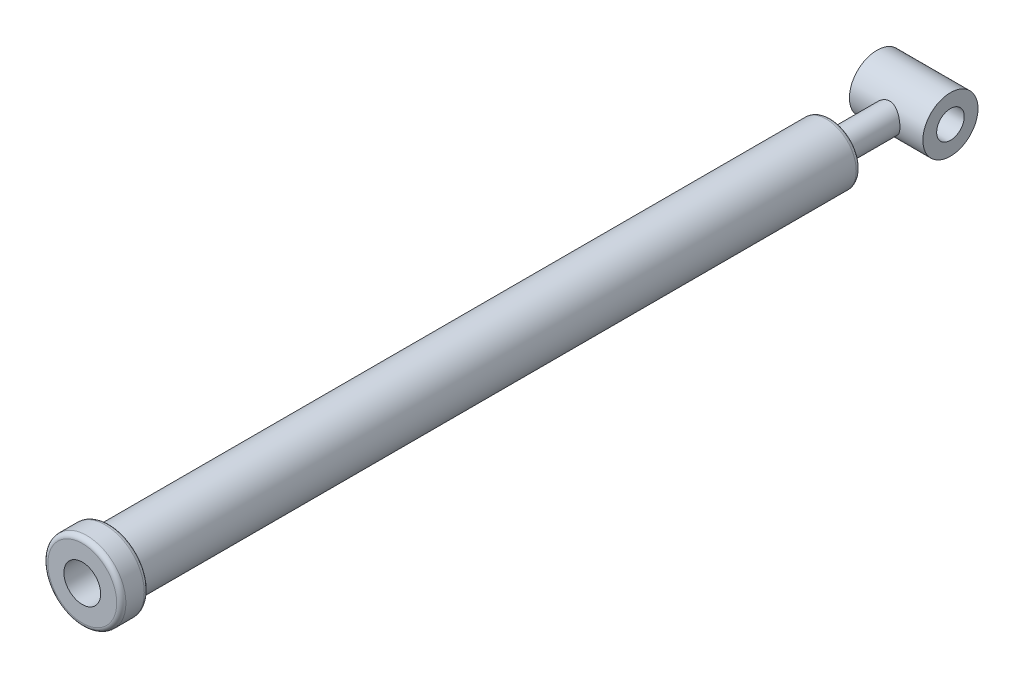
ISO-10303-21;
HEADER;
FILE_DESCRIPTION(('STEP AP214'),'2;1');
FILE_NAME('part.step','',(''),(''),'','','');
FILE_SCHEMA(('AUTOMOTIVE_DESIGN { 1 0 10303 214 1 1 1 1 }'));
ENDSEC;
DATA;
#1=APPLICATION_CONTEXT('core data for automotive mechanical design processes');
#2=APPLICATION_PROTOCOL_DEFINITION('international standard','automotive_design',2000,#1);
#3=PRODUCT_CONTEXT('',#1,'mechanical');
#4=PRODUCT('Part','Part','',(#3));
#5=PRODUCT_RELATED_PRODUCT_CATEGORY('part','',(#4));
#6=PRODUCT_DEFINITION_FORMATION('','',#4);
#7=PRODUCT_DEFINITION_CONTEXT('part definition',#1,'design');
#8=PRODUCT_DEFINITION('design','',#6,#7);
#9=PRODUCT_DEFINITION_SHAPE('','',#8);
#10=(LENGTH_UNIT() NAMED_UNIT(*) SI_UNIT(.MILLI.,.METRE.));
#11=(NAMED_UNIT(*) PLANE_ANGLE_UNIT() SI_UNIT($,.RADIAN.));
#12=(NAMED_UNIT(*) SI_UNIT($,.STERADIAN.) SOLID_ANGLE_UNIT());
#13=UNCERTAINTY_MEASURE_WITH_UNIT(LENGTH_MEASURE(1.E-05),#10,'distance_accuracy_value','');
#14=(GEOMETRIC_REPRESENTATION_CONTEXT(3) GLOBAL_UNCERTAINTY_ASSIGNED_CONTEXT((#13)) GLOBAL_UNIT_ASSIGNED_CONTEXT((#10,
#11,#12)) REPRESENTATION_CONTEXT('',''));
#15=CARTESIAN_POINT('',(0.,0.,0.));
#16=DIRECTION('',(0.,0.,1.));
#17=DIRECTION('',(1.,0.,0.));
#18=AXIS2_PLACEMENT_3D('',#15,#16,#17);
#19=CARTESIAN_POINT('',(0.,0.,-880.));
#20=DIRECTION('',(0.,0.,1.));
#21=DIRECTION('',(1.,0.,0.));
#22=AXIS2_PLACEMENT_3D('',#19,#20,#21);
#23=CYLINDRICAL_SURFACE('',#22,15.);
#24=CARTESIAN_POINT('',(0.,0.,-815.));
#25=DIRECTION('',(0.,0.,-1.));
#26=DIRECTION('',(-1.,0.,0.));
#27=AXIS2_PLACEMENT_3D('',#24,#25,#26);
#28=CIRCLE('',#27,15.);
#29=CARTESIAN_POINT('',(-15.,0.,-815.));
#30=VERTEX_POINT('',#29);
#31=EDGE_CURVE('E78',#30,#30,#28,.T.);
#32=ORIENTED_EDGE('',*,*,#31,.T.);
#33=EDGE_LOOP('',(#32));
#34=FACE_BOUND('',#33,.T.);
#35=CARTESIAN_POINT('',(15.,0.,-875.));
#36=CARTESIAN_POINT('',(14.9999986967893,-0.394466621474774,-875.000001198443));
#37=CARTESIAN_POINT('',(14.9844217290986,-0.788960822893598,-875.007798374441));
#38=CARTESIAN_POINT('',(14.9222912626951,-1.57504384672489,-875.038790696874));
#39=CARTESIAN_POINT('',(14.8757242881962,-1.96663133023565,-875.061992541911));
#40=CARTESIAN_POINT('',(14.752062134402,-2.74444839066597,-875.123245665513));
#41=CARTESIAN_POINT('',(14.674915671778,-3.13066783309047,-875.161321887591));
#42=CARTESIAN_POINT('',(14.4909926788045,-3.89427274204147,-875.251345482788));
#43=CARTESIAN_POINT('',(14.3842191117729,-4.27165908796738,-875.303291468628));
#44=CARTESIAN_POINT('',(14.1426464967422,-5.01370255233915,-875.419545464834));
#45=CARTESIAN_POINT('',(14.0079586988167,-5.37840368544458,-875.483804328683));
#46=CARTESIAN_POINT('',(13.7115835174738,-6.09447648128182,-875.623301187505));
#47=CARTESIAN_POINT('',(13.5498955527415,-6.44584785682342,-875.698539418861));
#48=CARTESIAN_POINT('',(13.2009461452605,-7.13327098283041,-875.858261390877));
#49=CARTESIAN_POINT('',(13.0136941461367,-7.4693283295993,-875.942741715132));
#50=CARTESIAN_POINT('',(12.6148696065897,-8.12479620523715,-876.119159593015));
#51=CARTESIAN_POINT('',(12.4032874777652,-8.44420009848104,-876.211100082431));
#52=CARTESIAN_POINT('',(11.9437431549207,-9.08356730455507,-876.406169485422));
#53=CARTESIAN_POINT('',(11.6943566948693,-9.40240338911198,-876.509638755958));
#54=CARTESIAN_POINT('',(11.1713323045258,-10.0182110858624,-876.720301058942));
#55=CARTESIAN_POINT('',(10.8976929878613,-10.3151814463611,-876.827494304051));
#56=CARTESIAN_POINT('',(10.32744213221,-10.8860835918351,-877.043134053405));
#57=CARTESIAN_POINT('',(10.0308163772597,-11.1600008976787,-877.151581297343));
#58=CARTESIAN_POINT('',(9.41609706949255,-11.6833254232374,-877.367048472574));
#59=CARTESIAN_POINT('',(9.09799950074795,-11.9327280363632,-877.474068132354));
#60=CARTESIAN_POINT('',(8.41621019135655,-12.424066666325,-877.692119687857));
#61=CARTESIAN_POINT('',(8.05089693128164,-12.6639084928373,-877.802814953086));
#62=CARTESIAN_POINT('',(7.29906225682786,-13.1116371457317,-878.01581142987));
#63=CARTESIAN_POINT('',(6.91254992484988,-13.3195375140209,-878.118116190041));
#64=CARTESIAN_POINT('',(6.12045119528939,-13.7015816677248,-878.310817756053));
#65=CARTESIAN_POINT('',(5.71487061752195,-13.8757356708103,-878.40121816361));
#66=CARTESIAN_POINT('',(4.88717106989482,-14.1884178363296,-878.566685065391));
#67=CARTESIAN_POINT('',(4.46505393858207,-14.3269499463523,-878.641753258529));
#68=CARTESIAN_POINT('',(3.63312743966091,-14.5593818816456,-878.769465636118));
#69=CARTESIAN_POINT('',(3.22409061692207,-14.6554546162323,-878.823181991672));
#70=CARTESIAN_POINT('',(2.3974253026042,-14.8131483158836,-878.912093372582));
#71=CARTESIAN_POINT('',(1.97979717934038,-14.874770754679,-878.947289190215));
#72=CARTESIAN_POINT('',(1.1399780978413,-14.9625716596024,-878.997615020556));
#73=CARTESIAN_POINT('',(0.717791304375857,-14.9887801055065,-879.012762005415));
#74=CARTESIAN_POINT('',(-0.127503752153197,-15.0054120092055,-879.022361014937));
#75=CARTESIAN_POINT('',(-0.550611923450829,-14.9958388811994,-879.016815014078));
#76=CARTESIAN_POINT('',(-1.34318604493256,-14.9443693637688,-878.987185469988));
#77=CARTESIAN_POINT('',(-1.7130074967434,-14.9064815133301,-878.965401642622));
#78=CARTESIAN_POINT('',(-2.44761394651885,-14.8036048078167,-878.90676729953));
#79=CARTESIAN_POINT('',(-2.81239941379462,-14.7386184959446,-878.869918197694));
#80=CARTESIAN_POINT('',(-3.53465011425935,-14.5822778462236,-878.782349877417));
#81=CARTESIAN_POINT('',(-3.8921134894694,-14.490916902454,-878.731627184297));
#82=CARTESIAN_POINT('',(-4.5975509702241,-14.2827793732036,-878.617879915435));
#83=CARTESIAN_POINT('',(-4.94552456919406,-14.1660014339124,-878.554854684428));
#84=CARTESIAN_POINT('',(-5.63806138553526,-13.9051185945145,-878.416735657268));
#85=CARTESIAN_POINT('',(-5.98236177926314,-13.7604466030275,-878.341397479624));
#86=CARTESIAN_POINT('',(-6.65764881287019,-13.4467240006949,-878.181786349803));
#87=CARTESIAN_POINT('',(-6.9886306367092,-13.2776646708395,-878.097510204973));
#88=CARTESIAN_POINT('',(-7.63583954119808,-12.9163207460711,-877.922168121219));
#89=CARTESIAN_POINT('',(-7.95206429387355,-12.724032503779,-877.831101116863));
#90=CARTESIAN_POINT('',(-8.56852275615349,-12.3173373374607,-877.644319137144));
#91=CARTESIAN_POINT('',(-8.86875518007752,-12.1029286391493,-877.548603789262));
#92=CARTESIAN_POINT('',(-9.48921356105551,-11.6244221009996,-877.342288154575));
#93=CARTESIAN_POINT('',(-9.80713018813409,-11.357472454083,-877.23134228918));
#94=CARTESIAN_POINT('',(-10.4195910602954,-10.7983337273758,-877.009171948651));
#95=CARTESIAN_POINT('',(-10.7141433900476,-10.5061534517949,-876.897947583749));
#96=CARTESIAN_POINT('',(-11.2787205781467,-9.89761910582897,-876.677890344788));
#97=CARTESIAN_POINT('',(-11.5487236024523,-9.58124396820905,-876.569059663621));
#98=CARTESIAN_POINT('',(-12.0621805278786,-8.92619254193717,-876.356648454252));
#99=CARTESIAN_POINT('',(-12.3056450163623,-8.58752523371366,-876.253065841263));
#100=CARTESIAN_POINT('',(-12.7751937974681,-7.87309152384946,-876.049027950798));
#101=CARTESIAN_POINT('',(-12.999931268877,-7.49633062281164,-875.94894596163));
#102=CARTESIAN_POINT('',(-13.4165538554255,-6.72229496746225,-875.760139769321));
#103=CARTESIAN_POINT('',(-13.608437440683,-6.32501925897374,-875.671416095143));
#104=CARTESIAN_POINT('',(-13.9571914545699,-5.51289034160744,-875.507976152198));
#105=CARTESIAN_POINT('',(-14.1140841452216,-5.09804850978522,-875.433250982128));
#106=CARTESIAN_POINT('',(-14.391076168471,-4.25373396764104,-875.300028469866));
#107=CARTESIAN_POINT('',(-14.5111797336915,-3.82426294674312,-875.241529260936));
#108=CARTESIAN_POINT('',(-14.7045987917793,-2.99040123124789,-875.146713024642));
#109=CARTESIAN_POINT('',(-14.780965864728,-2.58687987737183,-875.108959937918));
#110=CARTESIAN_POINT('',(-14.9004227368483,-1.77375891598894,-875.049709617986));
#111=CARTESIAN_POINT('',(-14.9435143460633,-1.36415964033065,-875.028211500579));
#112=CARTESIAN_POINT('',(-14.9958394822899,-0.542432179601619,-875.002088586177));
#113=CARTESIAN_POINT('',(-15.0050865466642,-0.130305071717037,-874.997457042783));
#114=CARTESIAN_POINT('',(-14.9896332143828,0.693142933067775,-875.005182902425));
#115=CARTESIAN_POINT('',(-14.9649343201033,1.10446386484084,-875.017539553599));
#116=CARTESIAN_POINT('',(-14.8851569218173,1.89104365716466,-875.057274299687));
#117=CARTESIAN_POINT('',(-14.8325856924447,2.26662317638414,-875.083411784036));
#118=CARTESIAN_POINT('',(-14.6994449555599,3.01155508953995,-875.149198828482));
#119=CARTESIAN_POINT('',(-14.6188772495211,3.38090788254089,-875.188847519177));
#120=CARTESIAN_POINT('',(-14.4305792041858,4.11102643115709,-875.280732355606));
#121=CARTESIAN_POINT('',(-14.322847354219,4.47179170797618,-875.332969201392));
#122=CARTESIAN_POINT('',(-14.0812572947496,5.18257720416893,-875.448848110263));
#123=CARTESIAN_POINT('',(-13.9473979874992,5.53259697135359,-875.512490652549));
#124=CARTESIAN_POINT('',(-13.6505393721982,6.22979935488015,-875.651753782206));
#125=CARTESIAN_POINT('',(-13.4868176517073,6.576616120173,-875.727664302393));
#126=CARTESIAN_POINT('',(-13.1343016754682,7.25508680349727,-875.88839960015));
#127=CARTESIAN_POINT('',(-12.9455071994249,7.58674058826881,-875.973224456043));
#128=CARTESIAN_POINT('',(-12.5441531585986,8.23341158684491,-876.149985850757));
#129=CARTESIAN_POINT('',(-12.3315897999932,8.54842613296244,-876.241923524154));
#130=CARTESIAN_POINT('',(-11.8839483671782,9.16054648853287,-876.431012285166));
#131=CARTESIAN_POINT('',(-11.6488615394066,9.45764526147817,-876.528165393215));
#132=CARTESIAN_POINT('',(-11.1333715012893,10.060839107335,-876.735341464201));
#133=CARTESIAN_POINT('',(-10.8507851186195,10.3649587307601,-876.845692143983));
#134=CARTESIAN_POINT('',(-10.2616154855625,10.9485707923032,-877.06746929941));
#135=CARTESIAN_POINT('',(-9.9550311697726,11.2280621358615,-877.178895822626));
#136=CARTESIAN_POINT('',(-9.31919419442999,11.761157874002,-877.400027289832));
#137=CARTESIAN_POINT('',(-8.98992792709478,12.0147464980315,-877.50973115101));
#138=CARTESIAN_POINT('',(-8.31037887445767,12.4944228999317,-877.724397948994));
#139=CARTESIAN_POINT('',(-7.96009249191951,12.7205059505332,-877.829360068912));
#140=CARTESIAN_POINT('',(-7.22261605950783,13.1539172060939,-878.036414537209));
#141=CARTESIAN_POINT('',(-6.83445930863627,13.3597919511091,-878.138116937488));
#142=CARTESIAN_POINT('',(-6.03927850598328,13.737567232961,-878.329340387484));
#143=CARTESIAN_POINT('',(-5.63226376216402,13.9094843147169,-878.418867362678));
#144=CARTESIAN_POINT('',(-4.80217565091482,14.2174151642657,-878.582288068273));
#145=CARTESIAN_POINT('',(-4.37911544662186,14.353457663537,-878.656194299646));
#146=CARTESIAN_POINT('',(-3.51992505793521,14.5879514095295,-878.78531598748));
#147=CARTESIAN_POINT('',(-3.08379690851378,14.6864084766722,-878.840534337767));
#148=CARTESIAN_POINT('',(-2.24471283239244,14.8366134509912,-878.925460869571));
#149=CARTESIAN_POINT('',(-1.84259137531863,14.8919378625023,-878.957109030588));
#150=CARTESIAN_POINT('',(-1.0341590037221,14.9698153891526,-879.0017947784));
#151=CARTESIAN_POINT('',(-0.627848376009428,14.9923707330054,-879.014833630864));
#152=CARTESIAN_POINT('',(0.185270351507968,15.0043645010929,-879.021757365319));
#153=CARTESIAN_POINT('',(0.592078211651152,14.9938151743778,-879.015649331845));
#154=CARTESIAN_POINT('',(1.40275816467971,14.9397884815991,-878.984549012312));
#155=CARTESIAN_POINT('',(1.80663037706581,14.8963124635393,-878.959557499333));
#156=CARTESIAN_POINT('',(2.56967168244059,14.782795841076,-878.894967278986));
#157=CARTESIAN_POINT('',(2.92942204471818,14.7156934571528,-878.856994150101));
#158=CARTESIAN_POINT('',(3.64159381579529,14.5558242789108,-878.767646667704));
#159=CARTESIAN_POINT('',(3.99401275857395,14.4630489945772,-878.716267881271));
#160=CARTESIAN_POINT('',(4.68939648000362,14.2527724980854,-878.601651711384));
#161=CARTESIAN_POINT('',(5.0323611460618,14.1352709916016,-878.538414186773));
#162=CARTESIAN_POINT('',(5.70716431681701,13.8765585244577,-878.401832636467));
#163=CARTESIAN_POINT('',(6.0390017228925,13.7353452308956,-878.328487616466));
#164=CARTESIAN_POINT('',(6.71194905721808,13.4200195538921,-878.16836954442));
#165=CARTESIAN_POINT('',(7.05218633738287,13.2443351386714,-878.081025622915));
#166=CARTESIAN_POINT('',(7.71683729888767,12.8684192321827,-877.899310742732));
#167=CARTESIAN_POINT('',(8.04125049766908,12.6681869929773,-877.804939569978));
#168=CARTESIAN_POINT('',(8.67307599887717,12.2442855818538,-877.611466647555));
#169=CARTESIAN_POINT('',(8.9804818359264,12.0206075892618,-877.512363125188));
#170=CARTESIAN_POINT('',(9.57700095794095,11.5509819278367,-877.311734819274));
#171=CARTESIAN_POINT('',(9.86611149224955,11.3050309237573,-877.210209674785));
#172=CARTESIAN_POINT('',(10.4588881043877,10.7607009160988,-876.994588016576));
#173=CARTESIAN_POINT('',(10.7600384098886,10.4595848725634,-876.880466375821));
#174=CARTESIAN_POINT('',(11.3360350079751,9.83237263592984,-876.655062843985));
#175=CARTESIAN_POINT('',(11.6108894699081,9.50628425805799,-876.543780078878));
#176=CARTESIAN_POINT('',(12.1328673274452,8.83040064495091,-876.326840554529));
#177=CARTESIAN_POINT('',(12.3799686513199,8.48058689086185,-876.221188307768));
#178=CARTESIAN_POINT('',(12.8443186951047,7.75934315416603,-876.018404213272));
#179=CARTESIAN_POINT('',(13.0615691351246,7.38791441884538,-875.921271874707));
#180=CARTESIAN_POINT('',(13.4657554418474,6.62283359834588,-875.737499586337));
#181=CARTESIAN_POINT('',(13.652463307469,6.22904153096558,-875.650939674485));
#182=CARTESIAN_POINT('',(13.9917304392215,5.42422205013374,-875.491593102566));
#183=CARTESIAN_POINT('',(14.1442848128173,5.01319217734313,-875.418808416049));
#184=CARTESIAN_POINT('',(14.4130312534336,4.17809175418138,-875.289368363161));
#185=CARTESIAN_POINT('',(14.52931393542,3.75405665560561,-875.232672834932));
#186=CARTESIAN_POINT('',(14.7244141315277,2.89570983328148,-875.136960690795));
#187=CARTESIAN_POINT('',(14.8032545313493,2.46140455781254,-875.097933276359));
#188=CARTESIAN_POINT('',(14.9084233559045,1.68912528485808,-875.04570850057));
#189=CARTESIAN_POINT('',(14.9427351996439,1.35247752005866,-875.028597786956));
#190=CARTESIAN_POINT('',(14.9885243961843,0.67722664728,-875.005742865413));
#191=CARTESIAN_POINT('',(15.0000011187201,0.338623485589112,-874.999998971216));
#192=CARTESIAN_POINT('',(15.,0.,-875.));
#193=B_SPLINE_CURVE_WITH_KNOTS('',3,(#35,#36,#37,#38,#39,#40,#41,#42,#43,#44,#45,#46,#47,#48,
#49,#50,#51,#52,#53,#54,#55,#56,#57,#58,#59,#60,#61,#62,#63,#64,#65,#66,#67,#68,#69,#70,#71,#72,
#73,#74,#75,#76,#77,#78,#79,#80,#81,#82,#83,#84,#85,#86,#87,#88,#89,#90,#91,#92,#93,#94,#95,#96,
#97,#98,#99,#100,#101,#102,#103,#104,#105,#106,#107,#108,#109,#110,#111,#112,#113,#114,#115,
#116,#117,#118,#119,#120,#121,#122,#123,#124,#125,#126,#127,#128,#129,#130,#131,#132,#133,#134,
#135,#136,#137,#138,#139,#140,#141,#142,#143,#144,#145,#146,#147,#148,#149,#150,#151,#152,#153,
#154,#155,#156,#157,#158,#159,#160,#161,#162,#163,#164,#165,#166,#167,#168,#169,#170,#171,#172,
#173,#174,#175,#176,#177,#178,#179,#180,#181,#182,#183,#184,#185,#186,#187,#188,#189,#190,#191,
#192),.UNSPECIFIED.,.T.,.F.,(4,2,2,2,2,2,2,2,2,2,2,2,2,2,2,2,2,2,2,2,2,2,2,2,2,2,2,2,2,2,2,2,2,
2,2,2,2,2,2,2,2,2,2,2,2,2,2,2,2,2,2,2,2,2,2,2,2,2,2,2,2,2,2,2,2,2,2,2,2,2,2,2,2,2,2,2,2,2,4),
(0.,1.1830658838765,2.36664655205927,3.55222059958419,4.73767610811696,5.91849492154762,
7.09933916134024,8.27974835920213,9.46062435602728,10.7126941080732,11.9648354787241,
13.2177575130875,14.4709145374422,15.821667201721,17.1718456109054,18.521614574237,
19.8712338927467,21.1401798733571,22.4090715662491,23.6768884023223,24.9445842691984,
26.0604534443427,27.1762179182402,28.2922620948529,29.4083657309785,30.550157382565,
31.6923582661887,32.8347387306652,33.9772108970053,35.2649000045823,36.5521415758273,
37.8405170382692,39.1283766165387,40.4765138704575,41.824713885002,43.1720536807209,
44.519238405488,45.7548292237563,46.9903528264139,48.2253821822106,49.4603568799793,
50.5994583371908,51.7384865108584,52.8775780428886,54.0167174442702,55.1883567290371,
56.3600063087792,57.5318431666801,58.7041373111916,59.9914055352965,61.2787309408957,
62.5668355046821,63.8551611378706,65.2063513889893,66.5568816778175,67.9063270370393,
69.2555633384068,70.4752824018563,71.6949185050053,72.9141033841497,74.1332383531126,
75.2357784731185,76.3386836391977,77.4416019343193,78.5446288045349,79.7216927437009,
80.8987925552603,82.0763368112874,83.2540576898123,84.5752168212047,85.8959641652359,
87.217754555028,88.5394687467831,89.8706389488175,91.2019997209938,92.5300073067729,
93.8572021316087,94.872757858524,95.8883416150965),.UNSPECIFIED.);
#194=CARTESIAN_POINT('',(15.,0.,-875.));
#195=VERTEX_POINT('',#194);
#196=EDGE_CURVE('E69',#195,#195,#193,.T.);
#197=ORIENTED_EDGE('',*,*,#196,.F.);
#198=EDGE_LOOP('',(#197));
#199=FACE_BOUND('',#198,.T.);
#200=ADVANCED_FACE('F37',(#34,#199),#23,.T.);
#201=CARTESIAN_POINT('',(0.,0.,-30.));
#202=DIRECTION('',(0.,0.,1.));
#203=DIRECTION('',(1.,0.,0.));
#204=AXIS2_PLACEMENT_3D('',#201,#202,#203);
#205=PLANE('',#204);
#206=CARTESIAN_POINT('',(0.,0.,-30.));
#207=DIRECTION('',(0.,0.,1.));
#208=DIRECTION('',(1.,0.,0.));
#209=AXIS2_PLACEMENT_3D('',#206,#207,#208);
#210=CIRCLE('',#209,37.5);
#211=CARTESIAN_POINT('',(37.5,0.,-30.));
#212=VERTEX_POINT('',#211);
#213=EDGE_CURVE('E50',#212,#212,#210,.F.);
#214=ORIENTED_EDGE('',*,*,#213,.T.);
#215=EDGE_LOOP('',(#214));
#216=FACE_BOUND('',#215,.T.);
#217=CARTESIAN_POINT('',(0.,0.,-30.));
#218=DIRECTION('',(0.,0.,1.));
#219=DIRECTION('',(1.,0.,0.));
#220=AXIS2_PLACEMENT_3D('',#217,#218,#219);
#221=CIRCLE('',#220,32.5);
#222=CARTESIAN_POINT('',(32.5,0.,-30.));
#223=VERTEX_POINT('',#222);
#224=EDGE_CURVE('E79',#223,#223,#221,.F.);
#225=ORIENTED_EDGE('',*,*,#224,.F.);
#226=EDGE_LOOP('',(#225));
#227=FACE_BOUND('',#226,.T.);
#228=ADVANCED_FACE('F110',(#216,#227),#205,.F.);
#229=CARTESIAN_POINT('',(0.,0.,-30.));
#230=DIRECTION('',(0.,0.,1.));
#231=DIRECTION('',(1.,0.,0.));
#232=AXIS2_PLACEMENT_3D('',#229,#230,#231);
#233=CYLINDRICAL_SURFACE('',#232,42.5);
#234=CARTESIAN_POINT('',(0.,0.,-5.));
#235=DIRECTION('',(0.,0.,1.));
#236=DIRECTION('',(1.,0.,0.));
#237=AXIS2_PLACEMENT_3D('',#234,#235,#236);
#238=CIRCLE('',#237,42.5);
#239=CARTESIAN_POINT('',(42.5,0.,-5.));
#240=VERTEX_POINT('',#239);
#241=EDGE_CURVE('E55',#240,#240,#238,.F.);
#242=ORIENTED_EDGE('',*,*,#241,.T.);
#243=EDGE_LOOP('',(#242));
#244=FACE_BOUND('',#243,.T.);
#245=CARTESIAN_POINT('',(0.,0.,-25.));
#246=DIRECTION('',(0.,0.,1.));
#247=DIRECTION('',(1.,0.,0.));
#248=AXIS2_PLACEMENT_3D('',#245,#246,#247);
#249=CIRCLE('',#248,42.5);
#250=CARTESIAN_POINT('',(42.5,0.,-25.));
#251=VERTEX_POINT('',#250);
#252=EDGE_CURVE('E61',#251,#251,#249,.T.);
#253=ORIENTED_EDGE('',*,*,#252,.T.);
#254=EDGE_LOOP('',(#253));
#255=FACE_BOUND('',#254,.T.);
#256=ADVANCED_FACE('F115',(#244,#255),#233,.T.);
#257=CARTESIAN_POINT('',(0.,0.,0.));
#258=DIRECTION('',(0.,0.,1.));
#259=DIRECTION('',(1.,0.,0.));
#260=AXIS2_PLACEMENT_3D('',#257,#258,#259);
#261=PLANE('',#260);
#262=CARTESIAN_POINT('',(0.,0.,0.));
#263=DIRECTION('',(0.,0.,1.));
#264=DIRECTION('',(1.,0.,0.));
#265=AXIS2_PLACEMENT_3D('',#262,#263,#264);
#266=CIRCLE('',#265,37.5);
#267=CARTESIAN_POINT('',(37.5,0.,0.));
#268=VERTEX_POINT('',#267);
#269=EDGE_CURVE('E65',#268,#268,#266,.T.);
#270=ORIENTED_EDGE('',*,*,#269,.T.);
#271=EDGE_LOOP('',(#270));
#272=FACE_BOUND('',#271,.T.);
#273=CARTESIAN_POINT('',(0.,0.,0.));
#274=DIRECTION('',(0.,0.,1.));
#275=DIRECTION('',(1.,0.,0.));
#276=AXIS2_PLACEMENT_3D('',#273,#274,#275);
#277=CIRCLE('',#276,20.);
#278=CARTESIAN_POINT('',(20.,0.,0.));
#279=VERTEX_POINT('',#278);
#280=EDGE_CURVE('E128',#279,#279,#277,.T.);
#281=ORIENTED_EDGE('',*,*,#280,.F.);
#282=EDGE_LOOP('',(#281));
#283=FACE_BOUND('',#282,.T.);
#284=ADVANCED_FACE('F144',(#272,#283),#261,.T.);
#285=CARTESIAN_POINT('',(0.,0.,-30.));
#286=DIRECTION('',(0.,0.,1.));
#287=DIRECTION('',(1.,0.,0.));
#288=AXIS2_PLACEMENT_3D('',#285,#286,#287);
#289=CYLINDRICAL_SURFACE('',#288,20.);
#290=ORIENTED_EDGE('',*,*,#280,.T.);
#291=EDGE_LOOP('',(#290));
#292=FACE_BOUND('',#291,.T.);
#293=CARTESIAN_POINT('',(0.,0.,-810.));
#294=DIRECTION('',(0.,0.,-1.));
#295=DIRECTION('',(-1.,0.,0.));
#296=AXIS2_PLACEMENT_3D('',#293,#294,#295);
#297=CIRCLE('',#296,20.);
#298=CARTESIAN_POINT('',(-20.,0.,-810.));
#299=VERTEX_POINT('',#298);
#300=EDGE_CURVE('E133',#299,#299,#297,.T.);
#301=ORIENTED_EDGE('',*,*,#300,.T.);
#302=EDGE_LOOP('',(#301));
#303=FACE_BOUND('',#302,.T.);
#304=ADVANCED_FACE('F141',(#292,#303),#289,.F.);
#305=CARTESIAN_POINT('',(0.,0.,-810.));
#306=DIRECTION('',(0.,0.,1.));
#307=DIRECTION('',(1.,0.,0.));
#308=AXIS2_PLACEMENT_3D('',#305,#306,#307);
#309=CYLINDRICAL_SURFACE('',#308,32.5);
#310=CARTESIAN_POINT('',(0.,0.,-810.));
#311=DIRECTION('',(0.,0.,-1.));
#312=DIRECTION('',(-1.,0.,0.));
#313=AXIS2_PLACEMENT_3D('',#310,#311,#312);
#314=CIRCLE('',#313,32.5);
#315=CARTESIAN_POINT('',(-32.5,0.,-810.));
#316=VERTEX_POINT('',#315);
#317=EDGE_CURVE('E10',#316,#316,#314,.F.);
#318=ORIENTED_EDGE('',*,*,#317,.T.);
#319=EDGE_LOOP('',(#318));
#320=FACE_BOUND('',#319,.T.);
#321=ORIENTED_EDGE('',*,*,#224,.T.);
#322=EDGE_LOOP('',(#321));
#323=FACE_BOUND('',#322,.T.);
#324=ADVANCED_FACE('F152',(#320,#323),#309,.T.);
#325=CARTESIAN_POINT('',(0.,0.,-810.));
#326=DIRECTION('',(0.,0.,-1.));
#327=DIRECTION('',(-1.,0.,0.));
#328=AXIS2_PLACEMENT_3D('',#325,#326,#327);
#329=PLANE('',#328);
#330=ORIENTED_EDGE('',*,*,#300,.F.);
#331=EDGE_LOOP('',(#330));
#332=FACE_BOUND('',#331,.T.);
#333=ADVANCED_FACE('F170',(#332),#329,.F.);
#334=CARTESIAN_POINT('',(0.,0.,-815.));
#335=DIRECTION('',(0.,0.,-1.));
#336=DIRECTION('',(-1.,0.,0.));
#337=AXIS2_PLACEMENT_3D('',#334,#335,#336);
#338=PLANE('',#337);
#339=CARTESIAN_POINT('',(0.,0.,-815.));
#340=DIRECTION('',(0.,0.,-1.));
#341=DIRECTION('',(-1.,0.,0.));
#342=AXIS2_PLACEMENT_3D('',#339,#340,#341);
#343=CIRCLE('',#342,27.5);
#344=CARTESIAN_POINT('',(-27.5,0.,-815.));
#345=VERTEX_POINT('',#344);
#346=EDGE_CURVE('E45',#345,#345,#343,.T.);
#347=ORIENTED_EDGE('',*,*,#346,.T.);
#348=EDGE_LOOP('',(#347));
#349=FACE_BOUND('',#348,.T.);
#350=ORIENTED_EDGE('',*,*,#31,.F.);
#351=EDGE_LOOP('',(#350));
#352=FACE_BOUND('',#351,.T.);
#353=ADVANCED_FACE('F88',(#349,#352),#338,.T.);
#354=CARTESIAN_POINT('',(40.,0.,-905.));
#355=DIRECTION('',(-1.,0.,0.));
#356=DIRECTION('',(0.,0.,1.));
#357=AXIS2_PLACEMENT_3D('',#354,#355,#356);
#358=CYLINDRICAL_SURFACE('',#357,30.);
#359=CARTESIAN_POINT('',(-40.,0.,-905.));
#360=DIRECTION('',(1.,0.,0.));
#361=DIRECTION('',(0.,0.,-1.));
#362=AXIS2_PLACEMENT_3D('',#359,#360,#361);
#363=CIRCLE('',#362,30.);
#364=CARTESIAN_POINT('',(-40.,0.,-935.));
#365=VERTEX_POINT('',#364);
#366=EDGE_CURVE('E131',#365,#365,#363,.T.);
#367=ORIENTED_EDGE('',*,*,#366,.T.);
#368=EDGE_LOOP('',(#367));
#369=FACE_BOUND('',#368,.T.);
#370=CARTESIAN_POINT('',(40.,0.,-905.));
#371=DIRECTION('',(1.,0.,0.));
#372=DIRECTION('',(0.,0.,-1.));
#373=AXIS2_PLACEMENT_3D('',#370,#371,#372);
#374=CIRCLE('',#373,30.);
#375=CARTESIAN_POINT('',(40.,0.,-935.));
#376=VERTEX_POINT('',#375);
#377=EDGE_CURVE('E136',#376,#376,#374,.T.);
#378=ORIENTED_EDGE('',*,*,#377,.F.);
#379=EDGE_LOOP('',(#378));
#380=FACE_BOUND('',#379,.T.);
#381=ORIENTED_EDGE('',*,*,#196,.T.);
#382=EDGE_LOOP('',(#381));
#383=FACE_BOUND('',#382,.T.);
#384=ADVANCED_FACE('F83',(#369,#380,#383),#358,.T.);
#385=CARTESIAN_POINT('',(40.,0.,-905.));
#386=DIRECTION('',(1.,0.,0.));
#387=DIRECTION('',(0.,0.,-1.));
#388=AXIS2_PLACEMENT_3D('',#385,#386,#387);
#389=PLANE('',#388);
#390=ORIENTED_EDGE('',*,*,#377,.T.);
#391=EDGE_LOOP('',(#390));
#392=FACE_BOUND('',#391,.T.);
#393=CARTESIAN_POINT('',(40.,0.,-905.));
#394=DIRECTION('',(1.,0.,0.));
#395=DIRECTION('',(0.,0.,-1.));
#396=AXIS2_PLACEMENT_3D('',#393,#394,#395);
#397=CIRCLE('',#396,15.);
#398=CARTESIAN_POINT('',(40.,0.,-920.));
#399=VERTEX_POINT('',#398);
#400=EDGE_CURVE('E274',#399,#399,#397,.T.);
#401=ORIENTED_EDGE('',*,*,#400,.F.);
#402=EDGE_LOOP('',(#401));
#403=FACE_BOUND('',#402,.T.);
#404=ADVANCED_FACE('F87',(#392,#403),#389,.T.);
#405=CARTESIAN_POINT('',(-40.,0.,-905.));
#406=DIRECTION('',(1.,0.,0.));
#407=DIRECTION('',(0.,0.,-1.));
#408=AXIS2_PLACEMENT_3D('',#405,#406,#407);
#409=PLANE('',#408);
#410=ORIENTED_EDGE('',*,*,#366,.F.);
#411=EDGE_LOOP('',(#410));
#412=FACE_BOUND('',#411,.T.);
#413=CARTESIAN_POINT('',(-40.,0.,-905.));
#414=DIRECTION('',(1.,0.,0.));
#415=DIRECTION('',(0.,0.,-1.));
#416=AXIS2_PLACEMENT_3D('',#413,#414,#415);
#417=CIRCLE('',#416,15.);
#418=CARTESIAN_POINT('',(-40.,0.,-920.));
#419=VERTEX_POINT('',#418);
#420=EDGE_CURVE('E276',#419,#419,#417,.T.);
#421=ORIENTED_EDGE('',*,*,#420,.T.);
#422=EDGE_LOOP('',(#421));
#423=FACE_BOUND('',#422,.T.);
#424=ADVANCED_FACE('F90',(#412,#423),#409,.F.);
#425=CARTESIAN_POINT('',(40.,0.,-905.));
#426=DIRECTION('',(-1.,0.,0.));
#427=DIRECTION('',(0.,0.,1.));
#428=AXIS2_PLACEMENT_3D('',#425,#426,#427);
#429=CYLINDRICAL_SURFACE('',#428,15.);
#430=ORIENTED_EDGE('',*,*,#400,.T.);
#431=EDGE_LOOP('',(#430));
#432=FACE_BOUND('',#431,.T.);
#433=ORIENTED_EDGE('',*,*,#420,.F.);
#434=EDGE_LOOP('',(#433));
#435=FACE_BOUND('',#434,.T.);
#436=ADVANCED_FACE('F93',(#432,#435),#429,.F.);
#437=CARTESIAN_POINT('',(0.,0.,-5.));
#438=DIRECTION('',(0.,0.,1.));
#439=DIRECTION('',(1.,0.,0.));
#440=AXIS2_PLACEMENT_3D('',#437,#438,#439);
#441=TOROIDAL_SURFACE('',#440,37.5,5.);
#442=ORIENTED_EDGE('',*,*,#241,.F.);
#443=EDGE_LOOP('',(#442));
#444=FACE_BOUND('',#443,.T.);
#445=ORIENTED_EDGE('',*,*,#269,.F.);
#446=EDGE_LOOP('',(#445));
#447=FACE_BOUND('',#446,.T.);
#448=ADVANCED_FACE('F99',(#444,#447),#441,.T.);
#449=CARTESIAN_POINT('',(0.,0.,-25.));
#450=DIRECTION('',(0.,0.,1.));
#451=DIRECTION('',(1.,0.,0.));
#452=AXIS2_PLACEMENT_3D('',#449,#450,#451);
#453=TOROIDAL_SURFACE('',#452,37.5,5.);
#454=ORIENTED_EDGE('',*,*,#213,.F.);
#455=EDGE_LOOP('',(#454));
#456=FACE_BOUND('',#455,.T.);
#457=ORIENTED_EDGE('',*,*,#252,.F.);
#458=EDGE_LOOP('',(#457));
#459=FACE_BOUND('',#458,.T.);
#460=ADVANCED_FACE('F104',(#456,#459),#453,.T.);
#461=CARTESIAN_POINT('',(0.,0.,-810.));
#462=DIRECTION('',(0.,0.,-1.));
#463=DIRECTION('',(-1.,0.,0.));
#464=AXIS2_PLACEMENT_3D('',#461,#462,#463);
#465=TOROIDAL_SURFACE('',#464,27.5,5.);
#466=ORIENTED_EDGE('',*,*,#317,.F.);
#467=EDGE_LOOP('',(#466));
#468=FACE_BOUND('',#467,.T.);
#469=ORIENTED_EDGE('',*,*,#346,.F.);
#470=EDGE_LOOP('',(#469));
#471=FACE_BOUND('',#470,.T.);
#472=ADVANCED_FACE('F39',(#468,#471),#465,.T.);
#473=CLOSED_SHELL('',(#200,#228,#256,#284,#304,#324,#333,#353,#384,#404,#424,#436,#448,#460,#472));
#474=MANIFOLD_SOLID_BREP('B2',#473);
#475=ADVANCED_BREP_SHAPE_REPRESENTATION('',(#18,#474),#14);
#476=SHAPE_DEFINITION_REPRESENTATION(#9,#475);
ENDSEC;
END-ISO-10303-21;
